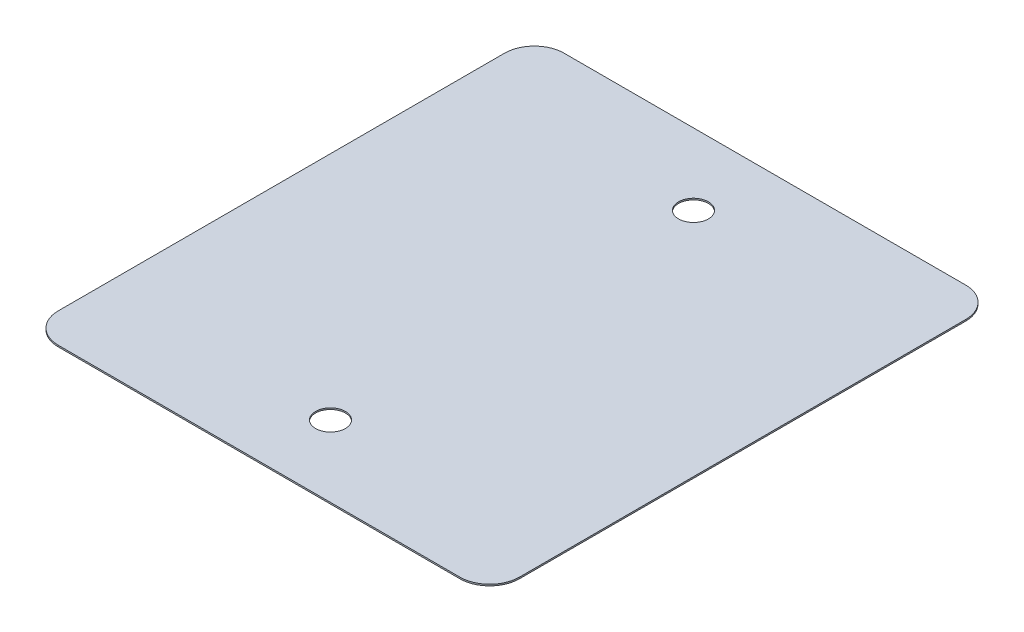
ISO-10303-21;
HEADER;
FILE_DESCRIPTION(('STEP AP214'),'2;1');
FILE_NAME('part.step','',(''),(''),'','','');
FILE_SCHEMA(('AUTOMOTIVE_DESIGN { 1 0 10303 214 1 1 1 1 }'));
ENDSEC;
DATA;
#1=APPLICATION_CONTEXT('core data for automotive mechanical design processes');
#2=APPLICATION_PROTOCOL_DEFINITION('international standard','automotive_design',2000,#1);
#3=PRODUCT_CONTEXT('',#1,'mechanical');
#4=PRODUCT('Part','Part','',(#3));
#5=PRODUCT_RELATED_PRODUCT_CATEGORY('part','',(#4));
#6=PRODUCT_DEFINITION_FORMATION('','',#4);
#7=PRODUCT_DEFINITION_CONTEXT('part definition',#1,'design');
#8=PRODUCT_DEFINITION('design','',#6,#7);
#9=PRODUCT_DEFINITION_SHAPE('','',#8);
#10=(LENGTH_UNIT() NAMED_UNIT(*) SI_UNIT(.MILLI.,.METRE.));
#11=(NAMED_UNIT(*) PLANE_ANGLE_UNIT() SI_UNIT($,.RADIAN.));
#12=(NAMED_UNIT(*) SI_UNIT($,.STERADIAN.) SOLID_ANGLE_UNIT());
#13=UNCERTAINTY_MEASURE_WITH_UNIT(LENGTH_MEASURE(1.E-05),#10,'distance_accuracy_value','');
#14=(GEOMETRIC_REPRESENTATION_CONTEXT(3) GLOBAL_UNCERTAINTY_ASSIGNED_CONTEXT((#13)) GLOBAL_UNIT_ASSIGNED_CONTEXT((#10,
#11,#12)) REPRESENTATION_CONTEXT('',''));
#15=CARTESIAN_POINT('',(0.,0.,0.));
#16=DIRECTION('',(0.,0.,1.));
#17=DIRECTION('',(1.,0.,0.));
#18=AXIS2_PLACEMENT_3D('',#15,#16,#17);
#19=CARTESIAN_POINT('',(-7.75,0.05,-8.5));
#20=DIRECTION('',(1.,0.,0.));
#21=DIRECTION('',(0.,0.,-1.));
#22=AXIS2_PLACEMENT_3D('',#19,#20,#21);
#23=PLANE('',#22);
#24=DIRECTION('',(0.,0.,1.));
#25=VECTOR('',#24,1.);
#26=CARTESIAN_POINT('',(-7.75,0.05,-8.5));
#27=LINE('',#26,#25);
#28=CARTESIAN_POINT('',(-7.75,0.05,-7.5));
#29=VERTEX_POINT('',#28);
#30=CARTESIAN_POINT('',(-7.75,0.05,7.5));
#31=VERTEX_POINT('',#30);
#32=EDGE_CURVE('E124',#29,#31,#27,.T.);
#33=ORIENTED_EDGE('',*,*,#32,.F.);
#34=DIRECTION('',(0.,-1.,0.));
#35=VECTOR('',#34,1.);
#36=CARTESIAN_POINT('',(-7.75,0.05,-7.5));
#37=LINE('',#36,#35);
#38=CARTESIAN_POINT('',(-7.75,0.,-7.5));
#39=VERTEX_POINT('',#38);
#40=EDGE_CURVE('E150',#29,#39,#37,.T.);
#41=ORIENTED_EDGE('',*,*,#40,.T.);
#42=DIRECTION('',(0.,0.,1.));
#43=VECTOR('',#42,1.);
#44=CARTESIAN_POINT('',(-7.75,0.,-8.5));
#45=LINE('',#44,#43);
#46=CARTESIAN_POINT('',(-7.75,0.,7.5));
#47=VERTEX_POINT('',#46);
#48=EDGE_CURVE('E156',#39,#47,#45,.T.);
#49=ORIENTED_EDGE('',*,*,#48,.T.);
#50=DIRECTION('',(0.,-1.,0.));
#51=VECTOR('',#50,1.);
#52=CARTESIAN_POINT('',(-7.75,0.05,7.5));
#53=LINE('',#52,#51);
#54=EDGE_CURVE('E148',#47,#31,#53,.F.);
#55=ORIENTED_EDGE('',*,*,#54,.T.);
#56=EDGE_LOOP('',(#33,#41,#49,#55));
#57=FACE_BOUND('',#56,.T.);
#58=ADVANCED_FACE('F32',(#57),#23,.F.);
#59=CARTESIAN_POINT('',(-7.75,0.05,8.5));
#60=DIRECTION('',(0.,0.,-1.));
#61=DIRECTION('',(-1.,0.,0.));
#62=AXIS2_PLACEMENT_3D('',#59,#60,#61);
#63=PLANE('',#62);
#64=DIRECTION('',(1.,0.,0.));
#65=VECTOR('',#64,1.);
#66=CARTESIAN_POINT('',(-7.75,0.05,8.5));
#67=LINE('',#66,#65);
#68=CARTESIAN_POINT('',(-6.75,0.05,8.5));
#69=VERTEX_POINT('',#68);
#70=CARTESIAN_POINT('',(6.75,0.05,8.5));
#71=VERTEX_POINT('',#70);
#72=EDGE_CURVE('E127',#69,#71,#67,.T.);
#73=ORIENTED_EDGE('',*,*,#72,.F.);
#74=DIRECTION('',(0.,-1.,0.));
#75=VECTOR('',#74,1.);
#76=CARTESIAN_POINT('',(-6.75,0.05,8.5));
#77=LINE('',#76,#75);
#78=CARTESIAN_POINT('',(-6.75,0.,8.5));
#79=VERTEX_POINT('',#78);
#80=EDGE_CURVE('E11',#69,#79,#77,.T.);
#81=ORIENTED_EDGE('',*,*,#80,.T.);
#82=DIRECTION('',(1.,0.,0.));
#83=VECTOR('',#82,1.);
#84=CARTESIAN_POINT('',(-7.75,0.,8.5));
#85=LINE('',#84,#83);
#86=CARTESIAN_POINT('',(6.75,0.,8.5));
#87=VERTEX_POINT('',#86);
#88=EDGE_CURVE('E129',#79,#87,#85,.T.);
#89=ORIENTED_EDGE('',*,*,#88,.T.);
#90=DIRECTION('',(0.,-1.,0.));
#91=VECTOR('',#90,1.);
#92=CARTESIAN_POINT('',(6.75,0.05,8.5));
#93=LINE('',#92,#91);
#94=EDGE_CURVE('E40',#87,#71,#93,.F.);
#95=ORIENTED_EDGE('',*,*,#94,.T.);
#96=EDGE_LOOP('',(#73,#81,#89,#95));
#97=FACE_BOUND('',#96,.T.);
#98=ADVANCED_FACE('F201',(#97),#63,.F.);
#99=CARTESIAN_POINT('',(7.75,0.05,-8.5));
#100=DIRECTION('',(-1.,0.,0.));
#101=DIRECTION('',(0.,0.,1.));
#102=AXIS2_PLACEMENT_3D('',#99,#100,#101);
#103=PLANE('',#102);
#104=DIRECTION('',(0.,0.,-1.));
#105=VECTOR('',#104,1.);
#106=CARTESIAN_POINT('',(7.75,0.,-8.5));
#107=LINE('',#106,#105);
#108=CARTESIAN_POINT('',(7.75,0.,7.5));
#109=VERTEX_POINT('',#108);
#110=CARTESIAN_POINT('',(7.75,0.,-7.5));
#111=VERTEX_POINT('',#110);
#112=EDGE_CURVE('E125',#109,#111,#107,.T.);
#113=ORIENTED_EDGE('',*,*,#112,.T.);
#114=DIRECTION('',(0.,-1.,0.));
#115=VECTOR('',#114,1.);
#116=CARTESIAN_POINT('',(7.75,0.05,-7.5));
#117=LINE('',#116,#115);
#118=CARTESIAN_POINT('',(7.75,0.05,-7.5));
#119=VERTEX_POINT('',#118);
#120=EDGE_CURVE('E103',#111,#119,#117,.F.);
#121=ORIENTED_EDGE('',*,*,#120,.T.);
#122=DIRECTION('',(0.,0.,-1.));
#123=VECTOR('',#122,1.);
#124=CARTESIAN_POINT('',(7.75,0.05,-8.5));
#125=LINE('',#124,#123);
#126=CARTESIAN_POINT('',(7.75,0.05,7.5));
#127=VERTEX_POINT('',#126);
#128=EDGE_CURVE('E168',#127,#119,#125,.T.);
#129=ORIENTED_EDGE('',*,*,#128,.F.);
#130=DIRECTION('',(0.,-1.,0.));
#131=VECTOR('',#130,1.);
#132=CARTESIAN_POINT('',(7.75,0.05,7.5));
#133=LINE('',#132,#131);
#134=EDGE_CURVE('E108',#127,#109,#133,.T.);
#135=ORIENTED_EDGE('',*,*,#134,.T.);
#136=EDGE_LOOP('',(#113,#121,#129,#135));
#137=FACE_BOUND('',#136,.T.);
#138=ADVANCED_FACE('F199',(#137),#103,.F.);
#139=CARTESIAN_POINT('',(-7.75,0.05,-8.5));
#140=DIRECTION('',(0.,0.,1.));
#141=DIRECTION('',(1.,0.,0.));
#142=AXIS2_PLACEMENT_3D('',#139,#140,#141);
#143=PLANE('',#142);
#144=DIRECTION('',(-1.,0.,0.));
#145=VECTOR('',#144,1.);
#146=CARTESIAN_POINT('',(-7.75,0.05,-8.5));
#147=LINE('',#146,#145);
#148=CARTESIAN_POINT('',(6.75,0.05,-8.5));
#149=VERTEX_POINT('',#148);
#150=CARTESIAN_POINT('',(-6.75,0.05,-8.5));
#151=VERTEX_POINT('',#150);
#152=EDGE_CURVE('E118',#149,#151,#147,.T.);
#153=ORIENTED_EDGE('',*,*,#152,.F.);
#154=DIRECTION('',(0.,-1.,0.));
#155=VECTOR('',#154,1.);
#156=CARTESIAN_POINT('',(6.75,0.05,-8.5));
#157=LINE('',#156,#155);
#158=CARTESIAN_POINT('',(6.75,0.,-8.5));
#159=VERTEX_POINT('',#158);
#160=EDGE_CURVE('E102',#149,#159,#157,.T.);
#161=ORIENTED_EDGE('',*,*,#160,.T.);
#162=DIRECTION('',(-1.,0.,0.));
#163=VECTOR('',#162,1.);
#164=CARTESIAN_POINT('',(-7.75,0.,-8.5));
#165=LINE('',#164,#163);
#166=CARTESIAN_POINT('',(-6.75,0.,-8.5));
#167=VERTEX_POINT('',#166);
#168=EDGE_CURVE('E115',#159,#167,#165,.T.);
#169=ORIENTED_EDGE('',*,*,#168,.T.);
#170=DIRECTION('',(0.,-1.,0.));
#171=VECTOR('',#170,1.);
#172=CARTESIAN_POINT('',(-6.75,0.05,-8.5));
#173=LINE('',#172,#171);
#174=EDGE_CURVE('E120',#167,#151,#173,.F.);
#175=ORIENTED_EDGE('',*,*,#174,.T.);
#176=EDGE_LOOP('',(#153,#161,#169,#175));
#177=FACE_BOUND('',#176,.T.);
#178=ADVANCED_FACE('F114',(#177),#143,.F.);
#179=CARTESIAN_POINT('',(-7.75,0.05,8.5));
#180=DIRECTION('',(0.,1.,0.));
#181=DIRECTION('',(0.,0.,1.));
#182=AXIS2_PLACEMENT_3D('',#179,#180,#181);
#183=PLANE('',#182);
#184=CARTESIAN_POINT('',(0.,0.05,6.1));
#185=DIRECTION('',(0.,1.,0.));
#186=DIRECTION('',(0.,0.,-1.));
#187=AXIS2_PLACEMENT_3D('',#184,#185,#186);
#188=CIRCLE('',#187,0.5);
#189=CARTESIAN_POINT('',(0.,0.05,5.6));
#190=VERTEX_POINT('',#189);
#191=EDGE_CURVE('E175',#190,#190,#188,.T.);
#192=ORIENTED_EDGE('',*,*,#191,.F.);
#193=EDGE_LOOP('',(#192));
#194=FACE_BOUND('',#193,.T.);
#195=CARTESIAN_POINT('',(0.,0.05,-6.1));
#196=DIRECTION('',(0.,1.,0.));
#197=DIRECTION('',(0.,0.,1.));
#198=AXIS2_PLACEMENT_3D('',#195,#196,#197);
#199=CIRCLE('',#198,0.5);
#200=CARTESIAN_POINT('',(0.,0.05,-5.6));
#201=VERTEX_POINT('',#200);
#202=EDGE_CURVE('E164',#201,#201,#199,.T.);
#203=ORIENTED_EDGE('',*,*,#202,.F.);
#204=EDGE_LOOP('',(#203));
#205=FACE_BOUND('',#204,.T.);
#206=ORIENTED_EDGE('',*,*,#128,.T.);
#207=CARTESIAN_POINT('',(6.75,0.05,-7.5));
#208=DIRECTION('',(0.,1.,0.));
#209=DIRECTION('',(0.,0.,1.));
#210=AXIS2_PLACEMENT_3D('',#207,#208,#209);
#211=CIRCLE('',#210,1.);
#212=EDGE_CURVE('E146',#119,#149,#211,.T.);
#213=ORIENTED_EDGE('',*,*,#212,.T.);
#214=ORIENTED_EDGE('',*,*,#152,.T.);
#215=CARTESIAN_POINT('',(-6.75,0.05,-7.5));
#216=DIRECTION('',(0.,1.,0.));
#217=DIRECTION('',(0.,0.,1.));
#218=AXIS2_PLACEMENT_3D('',#215,#216,#217);
#219=CIRCLE('',#218,1.);
#220=EDGE_CURVE('E144',#151,#29,#219,.T.);
#221=ORIENTED_EDGE('',*,*,#220,.T.);
#222=ORIENTED_EDGE('',*,*,#32,.T.);
#223=CARTESIAN_POINT('',(-6.75,0.05,7.5));
#224=DIRECTION('',(0.,1.,0.));
#225=DIRECTION('',(0.,0.,1.));
#226=AXIS2_PLACEMENT_3D('',#223,#224,#225);
#227=CIRCLE('',#226,1.);
#228=EDGE_CURVE('E53',#31,#69,#227,.T.);
#229=ORIENTED_EDGE('',*,*,#228,.T.);
#230=ORIENTED_EDGE('',*,*,#72,.T.);
#231=CARTESIAN_POINT('',(6.75,0.05,7.5));
#232=DIRECTION('',(0.,1.,0.));
#233=DIRECTION('',(0.,0.,1.));
#234=AXIS2_PLACEMENT_3D('',#231,#232,#233);
#235=CIRCLE('',#234,1.);
#236=EDGE_CURVE('E141',#71,#127,#235,.T.);
#237=ORIENTED_EDGE('',*,*,#236,.T.);
#238=EDGE_LOOP('',(#206,#213,#214,#221,#222,#229,#230,#237));
#239=FACE_BOUND('',#238,.T.);
#240=ADVANCED_FACE('F190',(#194,#205,#239),#183,.T.);
#241=CARTESIAN_POINT('',(-7.75,0.,8.5));
#242=DIRECTION('',(0.,1.,0.));
#243=DIRECTION('',(0.,0.,1.));
#244=AXIS2_PLACEMENT_3D('',#241,#242,#243);
#245=PLANE('',#244);
#246=CARTESIAN_POINT('',(0.,0.,6.1));
#247=DIRECTION('',(0.,1.,0.));
#248=DIRECTION('',(0.,0.,-1.));
#249=AXIS2_PLACEMENT_3D('',#246,#247,#248);
#250=CIRCLE('',#249,0.5);
#251=CARTESIAN_POINT('',(0.,0.,5.6));
#252=VERTEX_POINT('',#251);
#253=EDGE_CURVE('E173',#252,#252,#250,.T.);
#254=ORIENTED_EDGE('',*,*,#253,.T.);
#255=EDGE_LOOP('',(#254));
#256=FACE_BOUND('',#255,.T.);
#257=CARTESIAN_POINT('',(0.,0.,-6.1));
#258=DIRECTION('',(0.,1.,0.));
#259=DIRECTION('',(0.,0.,1.));
#260=AXIS2_PLACEMENT_3D('',#257,#258,#259);
#261=CIRCLE('',#260,0.5);
#262=CARTESIAN_POINT('',(0.,0.,-5.6));
#263=VERTEX_POINT('',#262);
#264=EDGE_CURVE('E161',#263,#263,#261,.T.);
#265=ORIENTED_EDGE('',*,*,#264,.T.);
#266=EDGE_LOOP('',(#265));
#267=FACE_BOUND('',#266,.T.);
#268=ORIENTED_EDGE('',*,*,#168,.F.);
#269=CARTESIAN_POINT('',(6.75,0.,-7.5));
#270=DIRECTION('',(0.,1.,0.));
#271=DIRECTION('',(0.,0.,1.));
#272=AXIS2_PLACEMENT_3D('',#269,#270,#271);
#273=CIRCLE('',#272,1.);
#274=EDGE_CURVE('E98',#159,#111,#273,.F.);
#275=ORIENTED_EDGE('',*,*,#274,.T.);
#276=ORIENTED_EDGE('',*,*,#112,.F.);
#277=CARTESIAN_POINT('',(6.75,0.,7.5));
#278=DIRECTION('',(0.,1.,0.));
#279=DIRECTION('',(0.,0.,1.));
#280=AXIS2_PLACEMENT_3D('',#277,#278,#279);
#281=CIRCLE('',#280,1.);
#282=EDGE_CURVE('E119',#109,#87,#281,.F.);
#283=ORIENTED_EDGE('',*,*,#282,.T.);
#284=ORIENTED_EDGE('',*,*,#88,.F.);
#285=CARTESIAN_POINT('',(-6.75,0.,7.5));
#286=DIRECTION('',(0.,1.,0.));
#287=DIRECTION('',(0.,0.,1.));
#288=AXIS2_PLACEMENT_3D('',#285,#286,#287);
#289=CIRCLE('',#288,1.);
#290=EDGE_CURVE('E135',#79,#47,#289,.F.);
#291=ORIENTED_EDGE('',*,*,#290,.T.);
#292=ORIENTED_EDGE('',*,*,#48,.F.);
#293=CARTESIAN_POINT('',(-6.75,0.,-7.5));
#294=DIRECTION('',(0.,1.,0.));
#295=DIRECTION('',(0.,0.,1.));
#296=AXIS2_PLACEMENT_3D('',#293,#294,#295);
#297=CIRCLE('',#296,1.);
#298=EDGE_CURVE('E109',#39,#167,#297,.F.);
#299=ORIENTED_EDGE('',*,*,#298,.T.);
#300=EDGE_LOOP('',(#268,#275,#276,#283,#284,#291,#292,#299));
#301=FACE_BOUND('',#300,.T.);
#302=ADVANCED_FACE('F122',(#256,#267,#301),#245,.F.);
#303=CARTESIAN_POINT('',(6.75,0.05,-7.5));
#304=DIRECTION('',(0.,-1.,0.));
#305=DIRECTION('',(0.,0.,-1.));
#306=AXIS2_PLACEMENT_3D('',#303,#304,#305);
#307=CYLINDRICAL_SURFACE('',#306,1.);
#308=ORIENTED_EDGE('',*,*,#212,.F.);
#309=ORIENTED_EDGE('',*,*,#120,.F.);
#310=ORIENTED_EDGE('',*,*,#274,.F.);
#311=ORIENTED_EDGE('',*,*,#160,.F.);
#312=EDGE_LOOP('',(#308,#309,#310,#311));
#313=FACE_BOUND('',#312,.T.);
#314=ADVANCED_FACE('F101',(#313),#307,.T.);
#315=CARTESIAN_POINT('',(-6.75,0.05,-7.5));
#316=DIRECTION('',(0.,-1.,0.));
#317=DIRECTION('',(0.,0.,-1.));
#318=AXIS2_PLACEMENT_3D('',#315,#316,#317);
#319=CYLINDRICAL_SURFACE('',#318,1.);
#320=ORIENTED_EDGE('',*,*,#220,.F.);
#321=ORIENTED_EDGE('',*,*,#174,.F.);
#322=ORIENTED_EDGE('',*,*,#298,.F.);
#323=ORIENTED_EDGE('',*,*,#40,.F.);
#324=EDGE_LOOP('',(#320,#321,#322,#323));
#325=FACE_BOUND('',#324,.T.);
#326=ADVANCED_FACE('F205',(#325),#319,.T.);
#327=CARTESIAN_POINT('',(-6.75,0.05,7.5));
#328=DIRECTION('',(0.,-1.,0.));
#329=DIRECTION('',(0.,0.,-1.));
#330=AXIS2_PLACEMENT_3D('',#327,#328,#329);
#331=CYLINDRICAL_SURFACE('',#330,1.);
#332=ORIENTED_EDGE('',*,*,#228,.F.);
#333=ORIENTED_EDGE('',*,*,#54,.F.);
#334=ORIENTED_EDGE('',*,*,#290,.F.);
#335=ORIENTED_EDGE('',*,*,#80,.F.);
#336=EDGE_LOOP('',(#332,#333,#334,#335));
#337=FACE_BOUND('',#336,.T.);
#338=ADVANCED_FACE('F204',(#337),#331,.T.);
#339=CARTESIAN_POINT('',(6.75,0.05,7.5));
#340=DIRECTION('',(0.,-1.,0.));
#341=DIRECTION('',(0.,0.,-1.));
#342=AXIS2_PLACEMENT_3D('',#339,#340,#341);
#343=CYLINDRICAL_SURFACE('',#342,1.);
#344=ORIENTED_EDGE('',*,*,#236,.F.);
#345=ORIENTED_EDGE('',*,*,#94,.F.);
#346=ORIENTED_EDGE('',*,*,#282,.F.);
#347=ORIENTED_EDGE('',*,*,#134,.F.);
#348=EDGE_LOOP('',(#344,#345,#346,#347));
#349=FACE_BOUND('',#348,.T.);
#350=ADVANCED_FACE('F34',(#349),#343,.T.);
#351=CARTESIAN_POINT('',(0.,0.,-6.1));
#352=DIRECTION('',(0.,1.,0.));
#353=DIRECTION('',(0.,0.,1.));
#354=AXIS2_PLACEMENT_3D('',#351,#352,#353);
#355=CYLINDRICAL_SURFACE('',#354,0.5);
#356=ORIENTED_EDGE('',*,*,#264,.F.);
#357=EDGE_LOOP('',(#356));
#358=FACE_BOUND('',#357,.T.);
#359=ORIENTED_EDGE('',*,*,#202,.T.);
#360=EDGE_LOOP('',(#359));
#361=FACE_BOUND('',#360,.T.);
#362=ADVANCED_FACE('F186',(#358,#361),#355,.F.);
#363=CARTESIAN_POINT('',(0.,0.,6.1));
#364=DIRECTION('',(0.,1.,0.));
#365=DIRECTION('',(0.,0.,1.));
#366=AXIS2_PLACEMENT_3D('',#363,#364,#365);
#367=CYLINDRICAL_SURFACE('',#366,0.5);
#368=ORIENTED_EDGE('',*,*,#253,.F.);
#369=EDGE_LOOP('',(#368));
#370=FACE_BOUND('',#369,.T.);
#371=ORIENTED_EDGE('',*,*,#191,.T.);
#372=EDGE_LOOP('',(#371));
#373=FACE_BOUND('',#372,.T.);
#374=ADVANCED_FACE('F183',(#370,#373),#367,.F.);
#375=CLOSED_SHELL('',(#58,#98,#138,#178,#240,#302,#314,#326,#338,#350,#362,#374));
#376=MANIFOLD_SOLID_BREP('B2',#375);
#377=ADVANCED_BREP_SHAPE_REPRESENTATION('',(#18,#376),#14);
#378=SHAPE_DEFINITION_REPRESENTATION(#9,#377);
ENDSEC;
END-ISO-10303-21;
